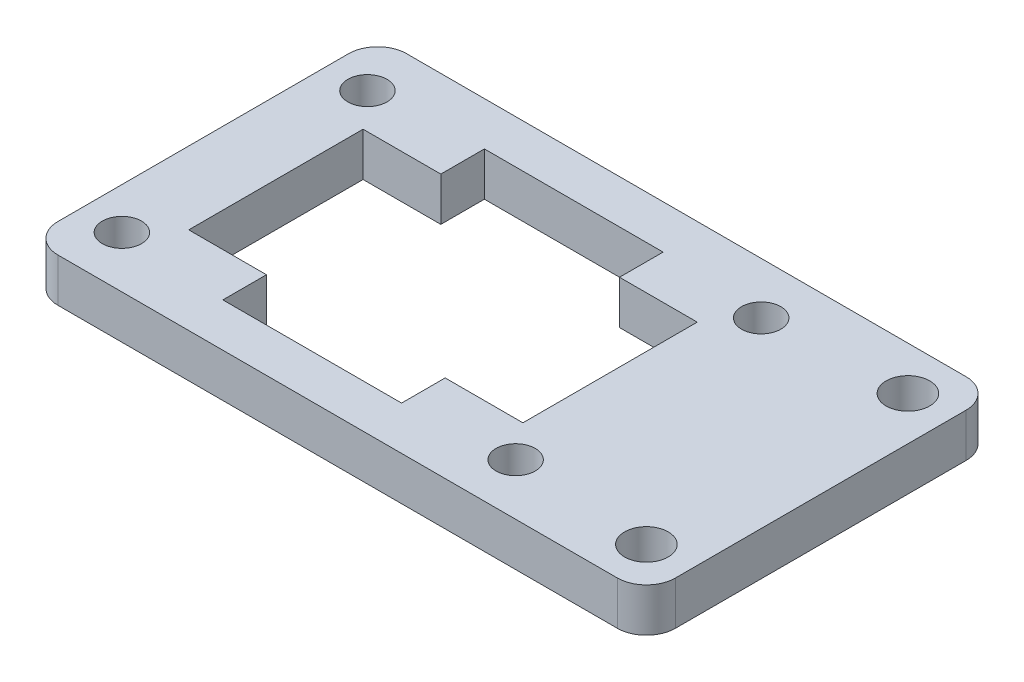
ISO-10303-21;
HEADER;
FILE_DESCRIPTION(('STEP AP214'),'2;1');
FILE_NAME('part.step','',(''),(''),'','','');
FILE_SCHEMA(('AUTOMOTIVE_DESIGN { 1 0 10303 214 1 1 1 1 }'));
ENDSEC;
DATA;
#1=APPLICATION_CONTEXT('core data for automotive mechanical design processes');
#2=APPLICATION_PROTOCOL_DEFINITION('international standard','automotive_design',2000,#1);
#3=PRODUCT_CONTEXT('',#1,'mechanical');
#4=PRODUCT('Part','Part','',(#3));
#5=PRODUCT_RELATED_PRODUCT_CATEGORY('part','',(#4));
#6=PRODUCT_DEFINITION_FORMATION('','',#4);
#7=PRODUCT_DEFINITION_CONTEXT('part definition',#1,'design');
#8=PRODUCT_DEFINITION('design','',#6,#7);
#9=PRODUCT_DEFINITION_SHAPE('','',#8);
#10=(LENGTH_UNIT() NAMED_UNIT(*) SI_UNIT(.MILLI.,.METRE.));
#11=(NAMED_UNIT(*) PLANE_ANGLE_UNIT() SI_UNIT($,.RADIAN.));
#12=(NAMED_UNIT(*) SI_UNIT($,.STERADIAN.) SOLID_ANGLE_UNIT());
#13=UNCERTAINTY_MEASURE_WITH_UNIT(LENGTH_MEASURE(1.E-05),#10,'distance_accuracy_value','');
#14=(GEOMETRIC_REPRESENTATION_CONTEXT(3) GLOBAL_UNCERTAINTY_ASSIGNED_CONTEXT((#13)) GLOBAL_UNIT_ASSIGNED_CONTEXT((#10,
#11,#12)) REPRESENTATION_CONTEXT('',''));
#15=CARTESIAN_POINT('',(0.,0.,0.));
#16=DIRECTION('',(0.,0.,1.));
#17=DIRECTION('',(1.,0.,0.));
#18=AXIS2_PLACEMENT_3D('',#15,#16,#17);
#19=CARTESIAN_POINT('',(0.,3.,-6.));
#20=DIRECTION('',(0.,0.,-1.));
#21=DIRECTION('',(-1.,0.,0.));
#22=AXIS2_PLACEMENT_3D('',#19,#20,#21);
#23=PLANE('',#22);
#24=DIRECTION('',(0.,1.,0.));
#25=VECTOR('',#24,1.);
#26=CARTESIAN_POINT('',(22.65,0.,-6.));
#27=LINE('',#26,#25);
#28=CARTESIAN_POINT('',(22.65,0.,-6.));
#29=VERTEX_POINT('',#28);
#30=CARTESIAN_POINT('',(22.65,3.,-6.));
#31=VERTEX_POINT('',#30);
#32=EDGE_CURVE('E329',#29,#31,#27,.T.);
#33=ORIENTED_EDGE('',*,*,#32,.T.);
#34=DIRECTION('',(1.,0.,0.));
#35=VECTOR('',#34,1.);
#36=CARTESIAN_POINT('',(0.,3.,-6.));
#37=LINE('',#36,#35);
#38=CARTESIAN_POINT('',(28.,3.,-6.));
#39=VERTEX_POINT('',#38);
#40=EDGE_CURVE('E358',#31,#39,#37,.T.);
#41=ORIENTED_EDGE('',*,*,#40,.T.);
#42=DIRECTION('',(0.,-1.,0.));
#43=VECTOR('',#42,1.);
#44=CARTESIAN_POINT('',(28.,3.,-6.));
#45=LINE('',#44,#43);
#46=CARTESIAN_POINT('',(28.,0.,-6.));
#47=VERTEX_POINT('',#46);
#48=EDGE_CURVE('E222',#39,#47,#45,.T.);
#49=ORIENTED_EDGE('',*,*,#48,.T.);
#50=DIRECTION('',(1.,0.,0.));
#51=VECTOR('',#50,1.);
#52=CARTESIAN_POINT('',(0.,0.,-6.));
#53=LINE('',#52,#51);
#54=EDGE_CURVE('E289',#29,#47,#53,.T.);
#55=ORIENTED_EDGE('',*,*,#54,.F.);
#56=EDGE_LOOP('',(#33,#41,#49,#55));
#57=FACE_BOUND('',#56,.T.);
#58=ADVANCED_FACE('F35',(#57),#23,.T.);
#59=CARTESIAN_POINT('',(0.,3.,-3.));
#60=DIRECTION('',(0.,0.,-1.));
#61=DIRECTION('',(-1.,0.,0.));
#62=AXIS2_PLACEMENT_3D('',#59,#60,#61);
#63=PLANE('',#62);
#64=DIRECTION('',(1.,0.,0.));
#65=VECTOR('',#64,1.);
#66=CARTESIAN_POINT('',(0.,0.,-3.));
#67=LINE('',#66,#65);
#68=CARTESIAN_POINT('',(10.35,0.,-3.));
#69=VERTEX_POINT('',#68);
#70=CARTESIAN_POINT('',(22.65,0.,-3.));
#71=VERTEX_POINT('',#70);
#72=EDGE_CURVE('E291',#69,#71,#67,.T.);
#73=ORIENTED_EDGE('',*,*,#72,.F.);
#74=DIRECTION('',(0.,1.,0.));
#75=VECTOR('',#74,1.);
#76=CARTESIAN_POINT('',(10.35,0.,-3.));
#77=LINE('',#76,#75);
#78=CARTESIAN_POINT('',(10.35,3.,-3.));
#79=VERTEX_POINT('',#78);
#80=EDGE_CURVE('E307',#69,#79,#77,.T.);
#81=ORIENTED_EDGE('',*,*,#80,.T.);
#82=DIRECTION('',(1.,0.,0.));
#83=VECTOR('',#82,1.);
#84=CARTESIAN_POINT('',(0.,3.,-3.));
#85=LINE('',#84,#83);
#86=CARTESIAN_POINT('',(22.65,3.,-3.));
#87=VERTEX_POINT('',#86);
#88=EDGE_CURVE('E360',#79,#87,#85,.T.);
#89=ORIENTED_EDGE('',*,*,#88,.T.);
#90=DIRECTION('',(0.,1.,0.));
#91=VECTOR('',#90,1.);
#92=CARTESIAN_POINT('',(22.65,0.,-3.));
#93=LINE('',#92,#91);
#94=EDGE_CURVE('E327',#71,#87,#93,.T.);
#95=ORIENTED_EDGE('',*,*,#94,.F.);
#96=EDGE_LOOP('',(#73,#81,#89,#95));
#97=FACE_BOUND('',#96,.T.);
#98=ADVANCED_FACE('F404',(#97),#63,.T.);
#99=DIRECTION('',(0.,1.,0.));
#100=VECTOR('',#99,1.);
#101=CARTESIAN_POINT('',(10.35,0.,-6.));
#102=LINE('',#101,#100);
#103=CARTESIAN_POINT('',(10.35,0.,-6.));
#104=VERTEX_POINT('',#103);
#105=CARTESIAN_POINT('',(10.35,3.,-6.));
#106=VERTEX_POINT('',#105);
#107=EDGE_CURVE('E302',#104,#106,#102,.T.);
#108=ORIENTED_EDGE('',*,*,#107,.F.);
#109=CARTESIAN_POINT('',(5.,0.,-6.));
#110=VERTEX_POINT('',#109);
#111=EDGE_CURVE('E204',#110,#104,#53,.T.);
#112=ORIENTED_EDGE('',*,*,#111,.F.);
#113=DIRECTION('',(0.,-1.,0.));
#114=VECTOR('',#113,1.);
#115=CARTESIAN_POINT('',(5.,3.,-6.));
#116=LINE('',#115,#114);
#117=CARTESIAN_POINT('',(5.,3.,-6.));
#118=VERTEX_POINT('',#117);
#119=EDGE_CURVE('E229',#118,#110,#116,.T.);
#120=ORIENTED_EDGE('',*,*,#119,.F.);
#121=EDGE_CURVE('E303',#118,#106,#37,.T.);
#122=ORIENTED_EDGE('',*,*,#121,.T.);
#123=EDGE_LOOP('',(#108,#112,#120,#122));
#124=FACE_BOUND('',#123,.T.);
#125=ADVANCED_FACE('F299',(#124),#23,.T.);
#126=CARTESIAN_POINT('',(5.,3.,0.));
#127=DIRECTION('',(1.,0.,0.));
#128=DIRECTION('',(0.,0.,-1.));
#129=AXIS2_PLACEMENT_3D('',#126,#127,#128);
#130=PLANE('',#129);
#131=DIRECTION('',(0.,0.,1.));
#132=VECTOR('',#131,1.);
#133=CARTESIAN_POINT('',(5.,0.,0.));
#134=LINE('',#133,#132);
#135=CARTESIAN_POINT('',(5.,0.,-18.));
#136=VERTEX_POINT('',#135);
#137=EDGE_CURVE('E200',#136,#110,#134,.T.);
#138=ORIENTED_EDGE('',*,*,#137,.F.);
#139=DIRECTION('',(0.,-1.,0.));
#140=VECTOR('',#139,1.);
#141=CARTESIAN_POINT('',(5.,3.,-18.));
#142=LINE('',#141,#140);
#143=CARTESIAN_POINT('',(5.,3.,-18.));
#144=VERTEX_POINT('',#143);
#145=EDGE_CURVE('E199',#144,#136,#142,.T.);
#146=ORIENTED_EDGE('',*,*,#145,.F.);
#147=DIRECTION('',(0.,0.,1.));
#148=VECTOR('',#147,1.);
#149=CARTESIAN_POINT('',(5.,3.,0.));
#150=LINE('',#149,#148);
#151=EDGE_CURVE('E362',#144,#118,#150,.T.);
#152=ORIENTED_EDGE('',*,*,#151,.T.);
#153=ORIENTED_EDGE('',*,*,#119,.T.);
#154=EDGE_LOOP('',(#138,#146,#152,#153));
#155=FACE_BOUND('',#154,.T.);
#156=ADVANCED_FACE('F414',(#155),#130,.T.);
#157=CARTESIAN_POINT('',(0.,3.,-18.));
#158=DIRECTION('',(0.,0.,-1.));
#159=DIRECTION('',(-1.,0.,0.));
#160=AXIS2_PLACEMENT_3D('',#157,#158,#159);
#161=PLANE('',#160);
#162=DIRECTION('',(1.,0.,0.));
#163=VECTOR('',#162,1.);
#164=CARTESIAN_POINT('',(0.,0.,-18.));
#165=LINE('',#164,#163);
#166=CARTESIAN_POINT('',(10.35,0.,-18.));
#167=VERTEX_POINT('',#166);
#168=EDGE_CURVE('E193',#136,#167,#165,.T.);
#169=ORIENTED_EDGE('',*,*,#168,.T.);
#170=DIRECTION('',(0.,1.,0.));
#171=VECTOR('',#170,1.);
#172=CARTESIAN_POINT('',(10.35,0.,-18.));
#173=LINE('',#172,#171);
#174=CARTESIAN_POINT('',(10.35,3.,-18.));
#175=VERTEX_POINT('',#174);
#176=EDGE_CURVE('E173',#167,#175,#173,.T.);
#177=ORIENTED_EDGE('',*,*,#176,.T.);
#178=DIRECTION('',(1.,0.,0.));
#179=VECTOR('',#178,1.);
#180=CARTESIAN_POINT('',(0.,3.,-18.));
#181=LINE('',#180,#179);
#182=EDGE_CURVE('E365',#144,#175,#181,.T.);
#183=ORIENTED_EDGE('',*,*,#182,.F.);
#184=ORIENTED_EDGE('',*,*,#145,.T.);
#185=EDGE_LOOP('',(#169,#177,#183,#184));
#186=FACE_BOUND('',#185,.T.);
#187=ADVANCED_FACE('F198',(#186),#161,.F.);
#188=CARTESIAN_POINT('',(0.,3.,-21.));
#189=DIRECTION('',(0.,0.,-1.));
#190=DIRECTION('',(-1.,0.,0.));
#191=AXIS2_PLACEMENT_3D('',#188,#189,#190);
#192=PLANE('',#191);
#193=DIRECTION('',(1.,0.,0.));
#194=VECTOR('',#193,1.);
#195=CARTESIAN_POINT('',(0.,0.,-21.));
#196=LINE('',#195,#194);
#197=CARTESIAN_POINT('',(10.35,0.,-21.));
#198=VERTEX_POINT('',#197);
#199=CARTESIAN_POINT('',(22.65,0.,-21.));
#200=VERTEX_POINT('',#199);
#201=EDGE_CURVE('E196',#198,#200,#196,.T.);
#202=ORIENTED_EDGE('',*,*,#201,.T.);
#203=DIRECTION('',(0.,1.,0.));
#204=VECTOR('',#203,1.);
#205=CARTESIAN_POINT('',(22.65,0.,-21.));
#206=LINE('',#205,#204);
#207=CARTESIAN_POINT('',(22.65,3.,-21.));
#208=VERTEX_POINT('',#207);
#209=EDGE_CURVE('E321',#200,#208,#206,.T.);
#210=ORIENTED_EDGE('',*,*,#209,.T.);
#211=DIRECTION('',(1.,0.,0.));
#212=VECTOR('',#211,1.);
#213=CARTESIAN_POINT('',(0.,3.,-21.));
#214=LINE('',#213,#212);
#215=CARTESIAN_POINT('',(10.35,3.,-21.));
#216=VERTEX_POINT('',#215);
#217=EDGE_CURVE('E367',#216,#208,#214,.T.);
#218=ORIENTED_EDGE('',*,*,#217,.F.);
#219=DIRECTION('',(0.,1.,0.));
#220=VECTOR('',#219,1.);
#221=CARTESIAN_POINT('',(10.35,0.,-21.));
#222=LINE('',#221,#220);
#223=EDGE_CURVE('E186',#198,#216,#222,.T.);
#224=ORIENTED_EDGE('',*,*,#223,.F.);
#225=EDGE_LOOP('',(#202,#210,#218,#224));
#226=FACE_BOUND('',#225,.T.);
#227=ADVANCED_FACE('F422',(#226),#192,.F.);
#228=CARTESIAN_POINT('',(22.65,3.,-18.));
#229=VERTEX_POINT('',#228);
#230=CARTESIAN_POINT('',(28.,3.,-18.));
#231=VERTEX_POINT('',#230);
#232=EDGE_CURVE('E368',#229,#231,#181,.T.);
#233=ORIENTED_EDGE('',*,*,#232,.F.);
#234=DIRECTION('',(0.,1.,0.));
#235=VECTOR('',#234,1.);
#236=CARTESIAN_POINT('',(22.65,0.,-18.));
#237=LINE('',#236,#235);
#238=CARTESIAN_POINT('',(22.65,0.,-18.));
#239=VERTEX_POINT('',#238);
#240=EDGE_CURVE('E318',#239,#229,#237,.T.);
#241=ORIENTED_EDGE('',*,*,#240,.F.);
#242=CARTESIAN_POINT('',(28.,0.,-18.));
#243=VERTEX_POINT('',#242);
#244=EDGE_CURVE('E202',#239,#243,#165,.T.);
#245=ORIENTED_EDGE('',*,*,#244,.T.);
#246=DIRECTION('',(0.,-1.,0.));
#247=VECTOR('',#246,1.);
#248=CARTESIAN_POINT('',(28.,3.,-18.));
#249=LINE('',#248,#247);
#250=EDGE_CURVE('E225',#231,#243,#249,.T.);
#251=ORIENTED_EDGE('',*,*,#250,.F.);
#252=EDGE_LOOP('',(#233,#241,#245,#251));
#253=FACE_BOUND('',#252,.T.);
#254=ADVANCED_FACE('F424',(#253),#161,.F.);
#255=CARTESIAN_POINT('',(0.,3.,0.));
#256=DIRECTION('',(0.,0.,-1.));
#257=DIRECTION('',(-1.,0.,0.));
#258=AXIS2_PLACEMENT_3D('',#255,#256,#257);
#259=PLANE('',#258);
#260=DIRECTION('',(1.,0.,0.));
#261=VECTOR('',#260,1.);
#262=CARTESIAN_POINT('',(0.,0.,0.));
#263=LINE('',#262,#261);
#264=CARTESIAN_POINT('',(2.,0.,0.));
#265=VERTEX_POINT('',#264);
#266=CARTESIAN_POINT('',(40.5,0.,0.));
#267=VERTEX_POINT('',#266);
#268=EDGE_CURVE('E266',#265,#267,#263,.T.);
#269=ORIENTED_EDGE('',*,*,#268,.T.);
#270=DIRECTION('',(0.,-1.,0.));
#271=VECTOR('',#270,1.);
#272=CARTESIAN_POINT('',(40.5,3.,0.));
#273=LINE('',#272,#271);
#274=CARTESIAN_POINT('',(40.5,3.,0.));
#275=VERTEX_POINT('',#274);
#276=EDGE_CURVE('E11',#267,#275,#273,.F.);
#277=ORIENTED_EDGE('',*,*,#276,.T.);
#278=DIRECTION('',(1.,0.,0.));
#279=VECTOR('',#278,1.);
#280=CARTESIAN_POINT('',(0.,3.,0.));
#281=LINE('',#280,#279);
#282=CARTESIAN_POINT('',(2.,3.,0.));
#283=VERTEX_POINT('',#282);
#284=EDGE_CURVE('E268',#283,#275,#281,.T.);
#285=ORIENTED_EDGE('',*,*,#284,.F.);
#286=DIRECTION('',(0.,-1.,0.));
#287=VECTOR('',#286,1.);
#288=CARTESIAN_POINT('',(2.,0.,0.));
#289=LINE('',#288,#287);
#290=EDGE_CURVE('E43',#283,#265,#289,.T.);
#291=ORIENTED_EDGE('',*,*,#290,.T.);
#292=EDGE_LOOP('',(#269,#277,#285,#291));
#293=FACE_BOUND('',#292,.T.);
#294=ADVANCED_FACE('F265',(#293),#259,.F.);
#295=CARTESIAN_POINT('',(42.5,3.,0.));
#296=DIRECTION('',(-1.,0.,0.));
#297=DIRECTION('',(0.,0.,1.));
#298=AXIS2_PLACEMENT_3D('',#295,#296,#297);
#299=PLANE('',#298);
#300=DIRECTION('',(0.,0.,-1.));
#301=VECTOR('',#300,1.);
#302=CARTESIAN_POINT('',(42.5,0.,0.));
#303=LINE('',#302,#301);
#304=CARTESIAN_POINT('',(42.5,0.,-2.));
#305=VERTEX_POINT('',#304);
#306=CARTESIAN_POINT('',(42.5,0.,-22.));
#307=VERTEX_POINT('',#306);
#308=EDGE_CURVE('E275',#305,#307,#303,.T.);
#309=ORIENTED_EDGE('',*,*,#308,.T.);
#310=DIRECTION('',(0.,-1.,0.));
#311=VECTOR('',#310,1.);
#312=CARTESIAN_POINT('',(42.5,3.,-22.));
#313=LINE('',#312,#311);
#314=CARTESIAN_POINT('',(42.5,3.,-22.));
#315=VERTEX_POINT('',#314);
#316=EDGE_CURVE('E50',#307,#315,#313,.F.);
#317=ORIENTED_EDGE('',*,*,#316,.T.);
#318=DIRECTION('',(0.,0.,-1.));
#319=VECTOR('',#318,1.);
#320=CARTESIAN_POINT('',(42.5,3.,0.));
#321=LINE('',#320,#319);
#322=CARTESIAN_POINT('',(42.5,3.,-2.));
#323=VERTEX_POINT('',#322);
#324=EDGE_CURVE('E350',#323,#315,#321,.T.);
#325=ORIENTED_EDGE('',*,*,#324,.F.);
#326=DIRECTION('',(0.,-1.,0.));
#327=VECTOR('',#326,1.);
#328=CARTESIAN_POINT('',(42.5,3.,-2.));
#329=LINE('',#328,#327);
#330=EDGE_CURVE('E256',#323,#305,#329,.T.);
#331=ORIENTED_EDGE('',*,*,#330,.T.);
#332=EDGE_LOOP('',(#309,#317,#325,#331));
#333=FACE_BOUND('',#332,.T.);
#334=ADVANCED_FACE('F539',(#333),#299,.F.);
#335=CARTESIAN_POINT('',(0.,3.,-24.));
#336=DIRECTION('',(0.,0.,-1.));
#337=DIRECTION('',(-1.,0.,0.));
#338=AXIS2_PLACEMENT_3D('',#335,#336,#337);
#339=PLANE('',#338);
#340=DIRECTION('',(1.,0.,0.));
#341=VECTOR('',#340,1.);
#342=CARTESIAN_POINT('',(0.,0.,-24.));
#343=LINE('',#342,#341);
#344=CARTESIAN_POINT('',(2.,0.,-24.));
#345=VERTEX_POINT('',#344);
#346=CARTESIAN_POINT('',(40.5,0.,-24.));
#347=VERTEX_POINT('',#346);
#348=EDGE_CURVE('E278',#345,#347,#343,.T.);
#349=ORIENTED_EDGE('',*,*,#348,.F.);
#350=DIRECTION('',(0.,-1.,0.));
#351=VECTOR('',#350,1.);
#352=CARTESIAN_POINT('',(2.,3.,-24.));
#353=LINE('',#352,#351);
#354=CARTESIAN_POINT('',(2.,3.,-24.));
#355=VERTEX_POINT('',#354);
#356=EDGE_CURVE('E247',#345,#355,#353,.F.);
#357=ORIENTED_EDGE('',*,*,#356,.T.);
#358=DIRECTION('',(1.,0.,0.));
#359=VECTOR('',#358,1.);
#360=CARTESIAN_POINT('',(0.,3.,-24.));
#361=LINE('',#360,#359);
#362=CARTESIAN_POINT('',(40.5,3.,-24.));
#363=VERTEX_POINT('',#362);
#364=EDGE_CURVE('E352',#355,#363,#361,.T.);
#365=ORIENTED_EDGE('',*,*,#364,.T.);
#366=DIRECTION('',(0.,-1.,0.));
#367=VECTOR('',#366,1.);
#368=CARTESIAN_POINT('',(40.5,0.,-24.));
#369=LINE('',#368,#367);
#370=EDGE_CURVE('E244',#363,#347,#369,.T.);
#371=ORIENTED_EDGE('',*,*,#370,.T.);
#372=EDGE_LOOP('',(#349,#357,#365,#371));
#373=FACE_BOUND('',#372,.T.);
#374=ADVANCED_FACE('F548',(#373),#339,.T.);
#375=CARTESIAN_POINT('',(0.,3.,0.));
#376=DIRECTION('',(-1.,0.,0.));
#377=DIRECTION('',(0.,0.,1.));
#378=AXIS2_PLACEMENT_3D('',#375,#376,#377);
#379=PLANE('',#378);
#380=DIRECTION('',(0.,0.,-1.));
#381=VECTOR('',#380,1.);
#382=CARTESIAN_POINT('',(0.,3.,0.));
#383=LINE('',#382,#381);
#384=CARTESIAN_POINT('',(0.,3.,-2.));
#385=VERTEX_POINT('',#384);
#386=CARTESIAN_POINT('',(0.,3.,-22.));
#387=VERTEX_POINT('',#386);
#388=EDGE_CURVE('E355',#385,#387,#383,.T.);
#389=ORIENTED_EDGE('',*,*,#388,.T.);
#390=DIRECTION('',(0.,-1.,0.));
#391=VECTOR('',#390,1.);
#392=CARTESIAN_POINT('',(0.,3.,-22.));
#393=LINE('',#392,#391);
#394=CARTESIAN_POINT('',(0.,0.,-22.));
#395=VERTEX_POINT('',#394);
#396=EDGE_CURVE('E233',#387,#395,#393,.T.);
#397=ORIENTED_EDGE('',*,*,#396,.T.);
#398=DIRECTION('',(0.,0.,-1.));
#399=VECTOR('',#398,1.);
#400=CARTESIAN_POINT('',(0.,0.,0.));
#401=LINE('',#400,#399);
#402=CARTESIAN_POINT('',(0.,0.,-2.));
#403=VERTEX_POINT('',#402);
#404=EDGE_CURVE('E287',#403,#395,#401,.T.);
#405=ORIENTED_EDGE('',*,*,#404,.F.);
#406=DIRECTION('',(0.,-1.,0.));
#407=VECTOR('',#406,1.);
#408=CARTESIAN_POINT('',(0.,3.,-2.));
#409=LINE('',#408,#407);
#410=EDGE_CURVE('E231',#403,#385,#409,.F.);
#411=ORIENTED_EDGE('',*,*,#410,.T.);
#412=EDGE_LOOP('',(#389,#397,#405,#411));
#413=FACE_BOUND('',#412,.T.);
#414=ADVANCED_FACE('F400',(#413),#379,.T.);
#415=CARTESIAN_POINT('',(2.85,3.,-20.45));
#416=DIRECTION('',(0.,-1.,0.));
#417=DIRECTION('',(0.,0.,-1.));
#418=AXIS2_PLACEMENT_3D('',#415,#416,#417);
#419=CYLINDRICAL_SURFACE('',#418,1.35);
#420=CARTESIAN_POINT('',(2.85,3.,-20.45));
#421=DIRECTION('',(0.,1.,0.));
#422=DIRECTION('',(0.,0.,1.));
#423=AXIS2_PLACEMENT_3D('',#420,#421,#422);
#424=CIRCLE('',#423,1.35);
#425=CARTESIAN_POINT('',(2.85,3.,-19.1));
#426=VERTEX_POINT('',#425);
#427=EDGE_CURVE('E346',#426,#426,#424,.T.);
#428=ORIENTED_EDGE('',*,*,#427,.T.);
#429=EDGE_LOOP('',(#428));
#430=FACE_BOUND('',#429,.T.);
#431=CARTESIAN_POINT('',(2.85,0.,-20.45));
#432=DIRECTION('',(0.,1.,0.));
#433=DIRECTION('',(0.,0.,1.));
#434=AXIS2_PLACEMENT_3D('',#431,#432,#433);
#435=CIRCLE('',#434,1.35);
#436=CARTESIAN_POINT('',(2.85,0.,-19.1));
#437=VERTEX_POINT('',#436);
#438=EDGE_CURVE('E276',#437,#437,#435,.T.);
#439=ORIENTED_EDGE('',*,*,#438,.F.);
#440=EDGE_LOOP('',(#439));
#441=FACE_BOUND('',#440,.T.);
#442=ADVANCED_FACE('F390',(#430,#441),#419,.F.);
#443=CARTESIAN_POINT('',(2.85,3.,-3.55));
#444=DIRECTION('',(0.,-1.,0.));
#445=DIRECTION('',(0.,0.,-1.));
#446=AXIS2_PLACEMENT_3D('',#443,#444,#445);
#447=CYLINDRICAL_SURFACE('',#446,1.35);
#448=CARTESIAN_POINT('',(2.85,3.,-3.55));
#449=DIRECTION('',(0.,1.,0.));
#450=DIRECTION('',(0.,0.,1.));
#451=AXIS2_PLACEMENT_3D('',#448,#449,#450);
#452=CIRCLE('',#451,1.35);
#453=CARTESIAN_POINT('',(2.85,3.,-2.2));
#454=VERTEX_POINT('',#453);
#455=EDGE_CURVE('E343',#454,#454,#452,.T.);
#456=ORIENTED_EDGE('',*,*,#455,.T.);
#457=EDGE_LOOP('',(#456));
#458=FACE_BOUND('',#457,.T.);
#459=CARTESIAN_POINT('',(2.85,0.,-3.55));
#460=DIRECTION('',(0.,1.,0.));
#461=DIRECTION('',(0.,0.,1.));
#462=AXIS2_PLACEMENT_3D('',#459,#460,#461);
#463=CIRCLE('',#462,1.35);
#464=CARTESIAN_POINT('',(2.85,0.,-2.2));
#465=VERTEX_POINT('',#464);
#466=EDGE_CURVE('E281',#465,#465,#463,.T.);
#467=ORIENTED_EDGE('',*,*,#466,.F.);
#468=EDGE_LOOP('',(#467));
#469=FACE_BOUND('',#468,.T.);
#470=ADVANCED_FACE('F387',(#458,#469),#447,.F.);
#471=CARTESIAN_POINT('',(29.95,3.,-20.45));
#472=DIRECTION('',(0.,-1.,0.));
#473=DIRECTION('',(0.,0.,-1.));
#474=AXIS2_PLACEMENT_3D('',#471,#472,#473);
#475=CYLINDRICAL_SURFACE('',#474,1.35);
#476=CARTESIAN_POINT('',(29.95,3.,-20.45));
#477=DIRECTION('',(0.,1.,0.));
#478=DIRECTION('',(0.,0.,1.));
#479=AXIS2_PLACEMENT_3D('',#476,#477,#478);
#480=CIRCLE('',#479,1.35);
#481=CARTESIAN_POINT('',(29.95,3.,-19.1));
#482=VERTEX_POINT('',#481);
#483=EDGE_CURVE('E340',#482,#482,#480,.T.);
#484=ORIENTED_EDGE('',*,*,#483,.T.);
#485=EDGE_LOOP('',(#484));
#486=FACE_BOUND('',#485,.T.);
#487=CARTESIAN_POINT('',(29.95,0.,-20.45));
#488=DIRECTION('',(0.,1.,0.));
#489=DIRECTION('',(0.,0.,1.));
#490=AXIS2_PLACEMENT_3D('',#487,#488,#489);
#491=CIRCLE('',#490,1.35);
#492=CARTESIAN_POINT('',(29.95,0.,-19.1));
#493=VERTEX_POINT('',#492);
#494=EDGE_CURVE('E380',#493,#493,#491,.T.);
#495=ORIENTED_EDGE('',*,*,#494,.F.);
#496=EDGE_LOOP('',(#495));
#497=FACE_BOUND('',#496,.T.);
#498=ADVANCED_FACE('F389',(#486,#497),#475,.F.);
#499=CARTESIAN_POINT('',(29.95,3.,-3.55));
#500=DIRECTION('',(0.,-1.,0.));
#501=DIRECTION('',(0.,0.,-1.));
#502=AXIS2_PLACEMENT_3D('',#499,#500,#501);
#503=CYLINDRICAL_SURFACE('',#502,1.35);
#504=CARTESIAN_POINT('',(29.95,3.,-3.55));
#505=DIRECTION('',(0.,1.,0.));
#506=DIRECTION('',(0.,0.,1.));
#507=AXIS2_PLACEMENT_3D('',#504,#505,#506);
#508=CIRCLE('',#507,1.35);
#509=CARTESIAN_POINT('',(29.95,3.,-2.2));
#510=VERTEX_POINT('',#509);
#511=EDGE_CURVE('E337',#510,#510,#508,.T.);
#512=ORIENTED_EDGE('',*,*,#511,.T.);
#513=EDGE_LOOP('',(#512));
#514=FACE_BOUND('',#513,.T.);
#515=CARTESIAN_POINT('',(29.95,0.,-3.55));
#516=DIRECTION('',(0.,1.,0.));
#517=DIRECTION('',(0.,0.,1.));
#518=AXIS2_PLACEMENT_3D('',#515,#516,#517);
#519=CIRCLE('',#518,1.35);
#520=CARTESIAN_POINT('',(29.95,0.,-2.2));
#521=VERTEX_POINT('',#520);
#522=EDGE_CURVE('E377',#521,#521,#519,.T.);
#523=ORIENTED_EDGE('',*,*,#522,.F.);
#524=EDGE_LOOP('',(#523));
#525=FACE_BOUND('',#524,.T.);
#526=ADVANCED_FACE('F397',(#514,#525),#503,.F.);
#527=CARTESIAN_POINT('',(39.5,3.,-3.));
#528=DIRECTION('',(0.,-1.,0.));
#529=DIRECTION('',(0.,0.,-1.));
#530=AXIS2_PLACEMENT_3D('',#527,#528,#529);
#531=CYLINDRICAL_SURFACE('',#530,1.5);
#532=CARTESIAN_POINT('',(39.5,3.,-3.));
#533=DIRECTION('',(0.,1.,0.));
#534=DIRECTION('',(0.,0.,1.));
#535=AXIS2_PLACEMENT_3D('',#532,#533,#534);
#536=CIRCLE('',#535,1.5);
#537=CARTESIAN_POINT('',(39.5,3.,-1.5));
#538=VERTEX_POINT('',#537);
#539=EDGE_CURVE('E219',#538,#538,#536,.T.);
#540=ORIENTED_EDGE('',*,*,#539,.T.);
#541=EDGE_LOOP('',(#540));
#542=FACE_BOUND('',#541,.T.);
#543=CARTESIAN_POINT('',(39.5,0.,-3.));
#544=DIRECTION('',(0.,1.,0.));
#545=DIRECTION('',(0.,0.,1.));
#546=AXIS2_PLACEMENT_3D('',#543,#544,#545);
#547=CIRCLE('',#546,1.5);
#548=CARTESIAN_POINT('',(39.5,0.,-1.5));
#549=VERTEX_POINT('',#548);
#550=EDGE_CURVE('E374',#549,#549,#547,.T.);
#551=ORIENTED_EDGE('',*,*,#550,.F.);
#552=EDGE_LOOP('',(#551));
#553=FACE_BOUND('',#552,.T.);
#554=ADVANCED_FACE('F593',(#542,#553),#531,.F.);
#555=CARTESIAN_POINT('',(39.5,3.,-21.));
#556=DIRECTION('',(0.,-1.,0.));
#557=DIRECTION('',(0.,0.,-1.));
#558=AXIS2_PLACEMENT_3D('',#555,#556,#557);
#559=CYLINDRICAL_SURFACE('',#558,1.5);
#560=CARTESIAN_POINT('',(39.5,3.,-21.));
#561=DIRECTION('',(0.,1.,0.));
#562=DIRECTION('',(0.,0.,1.));
#563=AXIS2_PLACEMENT_3D('',#560,#561,#562);
#564=CIRCLE('',#563,1.5);
#565=CARTESIAN_POINT('',(39.5,3.,-19.5));
#566=VERTEX_POINT('',#565);
#567=EDGE_CURVE('E213',#566,#566,#564,.T.);
#568=ORIENTED_EDGE('',*,*,#567,.T.);
#569=EDGE_LOOP('',(#568));
#570=FACE_BOUND('',#569,.T.);
#571=CARTESIAN_POINT('',(39.5,0.,-21.));
#572=DIRECTION('',(0.,1.,0.));
#573=DIRECTION('',(0.,0.,1.));
#574=AXIS2_PLACEMENT_3D('',#571,#572,#573);
#575=CIRCLE('',#574,1.5);
#576=CARTESIAN_POINT('',(39.5,0.,-19.5));
#577=VERTEX_POINT('',#576);
#578=EDGE_CURVE('E332',#577,#577,#575,.T.);
#579=ORIENTED_EDGE('',*,*,#578,.F.);
#580=EDGE_LOOP('',(#579));
#581=FACE_BOUND('',#580,.T.);
#582=ADVANCED_FACE('F434',(#570,#581),#559,.F.);
#583=CARTESIAN_POINT('',(28.,3.,0.));
#584=DIRECTION('',(1.,0.,0.));
#585=DIRECTION('',(0.,0.,-1.));
#586=AXIS2_PLACEMENT_3D('',#583,#584,#585);
#587=PLANE('',#586);
#588=DIRECTION('',(0.,0.,1.));
#589=VECTOR('',#588,1.);
#590=CARTESIAN_POINT('',(28.,0.,0.));
#591=LINE('',#590,#589);
#592=EDGE_CURVE('E206',#243,#47,#591,.T.);
#593=ORIENTED_EDGE('',*,*,#592,.T.);
#594=ORIENTED_EDGE('',*,*,#48,.F.);
#595=DIRECTION('',(0.,0.,1.));
#596=VECTOR('',#595,1.);
#597=CARTESIAN_POINT('',(28.,3.,0.));
#598=LINE('',#597,#596);
#599=EDGE_CURVE('E226',#231,#39,#598,.T.);
#600=ORIENTED_EDGE('',*,*,#599,.F.);
#601=ORIENTED_EDGE('',*,*,#250,.T.);
#602=EDGE_LOOP('',(#593,#594,#600,#601));
#603=FACE_BOUND('',#602,.T.);
#604=ADVANCED_FACE('F430',(#603),#587,.F.);
#605=CARTESIAN_POINT('',(0.,3.,0.));
#606=DIRECTION('',(0.,1.,0.));
#607=DIRECTION('',(0.,0.,1.));
#608=AXIS2_PLACEMENT_3D('',#605,#606,#607);
#609=PLANE('',#608);
#610=ORIENTED_EDGE('',*,*,#88,.F.);
#611=DIRECTION('',(0.,0.,1.));
#612=VECTOR('',#611,1.);
#613=CARTESIAN_POINT('',(10.35,3.,-6.));
#614=LINE('',#613,#612);
#615=EDGE_CURVE('E312',#106,#79,#614,.T.);
#616=ORIENTED_EDGE('',*,*,#615,.F.);
#617=ORIENTED_EDGE('',*,*,#121,.F.);
#618=ORIENTED_EDGE('',*,*,#151,.F.);
#619=ORIENTED_EDGE('',*,*,#182,.T.);
#620=DIRECTION('',(0.,0.,1.));
#621=VECTOR('',#620,1.);
#622=CARTESIAN_POINT('',(10.35,3.,-18.));
#623=LINE('',#622,#621);
#624=EDGE_CURVE('E180',#216,#175,#623,.T.);
#625=ORIENTED_EDGE('',*,*,#624,.F.);
#626=ORIENTED_EDGE('',*,*,#217,.T.);
#627=DIRECTION('',(0.,0.,-1.));
#628=VECTOR('',#627,1.);
#629=CARTESIAN_POINT('',(22.65,3.,-18.));
#630=LINE('',#629,#628);
#631=EDGE_CURVE('E185',#229,#208,#630,.T.);
#632=ORIENTED_EDGE('',*,*,#631,.F.);
#633=ORIENTED_EDGE('',*,*,#232,.T.);
#634=ORIENTED_EDGE('',*,*,#599,.T.);
#635=ORIENTED_EDGE('',*,*,#40,.F.);
#636=DIRECTION('',(0.,0.,-1.));
#637=VECTOR('',#636,1.);
#638=CARTESIAN_POINT('',(22.65,3.,-6.));
#639=LINE('',#638,#637);
#640=EDGE_CURVE('E310',#87,#31,#639,.T.);
#641=ORIENTED_EDGE('',*,*,#640,.F.);
#642=EDGE_LOOP('',(#610,#616,#617,#618,#619,#625,#626,#632,#633,#634,#635,#641));
#643=FACE_BOUND('',#642,.T.);
#644=ORIENTED_EDGE('',*,*,#567,.F.);
#645=EDGE_LOOP('',(#644));
#646=FACE_BOUND('',#645,.T.);
#647=ORIENTED_EDGE('',*,*,#539,.F.);
#648=EDGE_LOOP('',(#647));
#649=FACE_BOUND('',#648,.T.);
#650=ORIENTED_EDGE('',*,*,#511,.F.);
#651=EDGE_LOOP('',(#650));
#652=FACE_BOUND('',#651,.T.);
#653=ORIENTED_EDGE('',*,*,#483,.F.);
#654=EDGE_LOOP('',(#653));
#655=FACE_BOUND('',#654,.T.);
#656=ORIENTED_EDGE('',*,*,#455,.F.);
#657=EDGE_LOOP('',(#656));
#658=FACE_BOUND('',#657,.T.);
#659=ORIENTED_EDGE('',*,*,#427,.F.);
#660=EDGE_LOOP('',(#659));
#661=FACE_BOUND('',#660,.T.);
#662=ORIENTED_EDGE('',*,*,#364,.F.);
#663=CARTESIAN_POINT('',(2.,3.,-22.));
#664=DIRECTION('',(0.,1.,0.));
#665=DIRECTION('',(0.,0.,1.));
#666=AXIS2_PLACEMENT_3D('',#663,#664,#665);
#667=CIRCLE('',#666,2.);
#668=EDGE_CURVE('E254',#355,#387,#667,.T.);
#669=ORIENTED_EDGE('',*,*,#668,.T.);
#670=ORIENTED_EDGE('',*,*,#388,.F.);
#671=CARTESIAN_POINT('',(2.,3.,-2.));
#672=DIRECTION('',(0.,1.,0.));
#673=DIRECTION('',(0.,0.,1.));
#674=AXIS2_PLACEMENT_3D('',#671,#672,#673);
#675=CIRCLE('',#674,2.);
#676=EDGE_CURVE('E249',#385,#283,#675,.T.);
#677=ORIENTED_EDGE('',*,*,#676,.T.);
#678=ORIENTED_EDGE('',*,*,#284,.T.);
#679=CARTESIAN_POINT('',(40.5,3.,-2.));
#680=DIRECTION('',(0.,1.,0.));
#681=DIRECTION('',(0.,0.,1.));
#682=AXIS2_PLACEMENT_3D('',#679,#680,#681);
#683=CIRCLE('',#682,2.);
#684=EDGE_CURVE('E57',#275,#323,#683,.T.);
#685=ORIENTED_EDGE('',*,*,#684,.T.);
#686=ORIENTED_EDGE('',*,*,#324,.T.);
#687=CARTESIAN_POINT('',(40.5,3.,-22.));
#688=DIRECTION('',(0.,1.,0.));
#689=DIRECTION('',(0.,0.,1.));
#690=AXIS2_PLACEMENT_3D('',#687,#688,#689);
#691=CIRCLE('',#690,2.);
#692=EDGE_CURVE('E252',#315,#363,#691,.T.);
#693=ORIENTED_EDGE('',*,*,#692,.T.);
#694=EDGE_LOOP('',(#662,#669,#670,#677,#678,#685,#686,#693));
#695=FACE_BOUND('',#694,.T.);
#696=ADVANCED_FACE('F433',(#643,#646,#649,#652,#655,#658,#661,#695),#609,.T.);
#697=CARTESIAN_POINT('',(0.,0.,0.));
#698=DIRECTION('',(0.,1.,0.));
#699=DIRECTION('',(0.,0.,1.));
#700=AXIS2_PLACEMENT_3D('',#697,#698,#699);
#701=PLANE('',#700);
#702=ORIENTED_EDGE('',*,*,#578,.T.);
#703=EDGE_LOOP('',(#702));
#704=FACE_BOUND('',#703,.T.);
#705=ORIENTED_EDGE('',*,*,#550,.T.);
#706=EDGE_LOOP('',(#705));
#707=FACE_BOUND('',#706,.T.);
#708=ORIENTED_EDGE('',*,*,#522,.T.);
#709=EDGE_LOOP('',(#708));
#710=FACE_BOUND('',#709,.T.);
#711=ORIENTED_EDGE('',*,*,#494,.T.);
#712=EDGE_LOOP('',(#711));
#713=FACE_BOUND('',#712,.T.);
#714=ORIENTED_EDGE('',*,*,#466,.T.);
#715=EDGE_LOOP('',(#714));
#716=FACE_BOUND('',#715,.T.);
#717=ORIENTED_EDGE('',*,*,#438,.T.);
#718=EDGE_LOOP('',(#717));
#719=FACE_BOUND('',#718,.T.);
#720=ORIENTED_EDGE('',*,*,#404,.T.);
#721=CARTESIAN_POINT('',(2.,0.,-22.));
#722=DIRECTION('',(0.,1.,0.));
#723=DIRECTION('',(0.,0.,1.));
#724=AXIS2_PLACEMENT_3D('',#721,#722,#723);
#725=CIRCLE('',#724,2.);
#726=EDGE_CURVE('E242',#395,#345,#725,.F.);
#727=ORIENTED_EDGE('',*,*,#726,.T.);
#728=ORIENTED_EDGE('',*,*,#348,.T.);
#729=CARTESIAN_POINT('',(40.5,0.,-22.));
#730=DIRECTION('',(0.,1.,0.));
#731=DIRECTION('',(0.,0.,1.));
#732=AXIS2_PLACEMENT_3D('',#729,#730,#731);
#733=CIRCLE('',#732,2.);
#734=EDGE_CURVE('E240',#347,#307,#733,.F.);
#735=ORIENTED_EDGE('',*,*,#734,.T.);
#736=ORIENTED_EDGE('',*,*,#308,.F.);
#737=CARTESIAN_POINT('',(40.5,0.,-2.));
#738=DIRECTION('',(0.,1.,0.));
#739=DIRECTION('',(0.,0.,1.));
#740=AXIS2_PLACEMENT_3D('',#737,#738,#739);
#741=CIRCLE('',#740,2.);
#742=EDGE_CURVE('E238',#305,#267,#741,.F.);
#743=ORIENTED_EDGE('',*,*,#742,.T.);
#744=ORIENTED_EDGE('',*,*,#268,.F.);
#745=CARTESIAN_POINT('',(2.,0.,-2.));
#746=DIRECTION('',(0.,1.,0.));
#747=DIRECTION('',(0.,0.,1.));
#748=AXIS2_PLACEMENT_3D('',#745,#746,#747);
#749=CIRCLE('',#748,2.);
#750=EDGE_CURVE('E236',#265,#403,#749,.F.);
#751=ORIENTED_EDGE('',*,*,#750,.T.);
#752=EDGE_LOOP('',(#720,#727,#728,#735,#736,#743,#744,#751));
#753=FACE_BOUND('',#752,.T.);
#754=DIRECTION('',(0.,0.,1.));
#755=VECTOR('',#754,1.);
#756=CARTESIAN_POINT('',(10.35,0.,-6.));
#757=LINE('',#756,#755);
#758=EDGE_CURVE('E296',#104,#69,#757,.T.);
#759=ORIENTED_EDGE('',*,*,#758,.T.);
#760=ORIENTED_EDGE('',*,*,#72,.T.);
#761=DIRECTION('',(0.,0.,-1.));
#762=VECTOR('',#761,1.);
#763=CARTESIAN_POINT('',(22.65,0.,-6.));
#764=LINE('',#763,#762);
#765=EDGE_CURVE('E325',#71,#29,#764,.T.);
#766=ORIENTED_EDGE('',*,*,#765,.T.);
#767=ORIENTED_EDGE('',*,*,#54,.T.);
#768=ORIENTED_EDGE('',*,*,#592,.F.);
#769=ORIENTED_EDGE('',*,*,#244,.F.);
#770=DIRECTION('',(0.,0.,-1.));
#771=VECTOR('',#770,1.);
#772=CARTESIAN_POINT('',(22.65,0.,-18.));
#773=LINE('',#772,#771);
#774=EDGE_CURVE('E316',#239,#200,#773,.T.);
#775=ORIENTED_EDGE('',*,*,#774,.T.);
#776=ORIENTED_EDGE('',*,*,#201,.F.);
#777=DIRECTION('',(0.,0.,1.));
#778=VECTOR('',#777,1.);
#779=CARTESIAN_POINT('',(10.35,0.,-18.));
#780=LINE('',#779,#778);
#781=EDGE_CURVE('E177',#198,#167,#780,.T.);
#782=ORIENTED_EDGE('',*,*,#781,.T.);
#783=ORIENTED_EDGE('',*,*,#168,.F.);
#784=ORIENTED_EDGE('',*,*,#137,.T.);
#785=ORIENTED_EDGE('',*,*,#111,.T.);
#786=EDGE_LOOP('',(#759,#760,#766,#767,#768,#769,#775,#776,#782,#783,#784,#785));
#787=FACE_BOUND('',#786,.T.);
#788=ADVANCED_FACE('F191',(#704,#707,#710,#713,#716,#719,#753,#787),#701,.F.);
#789=CARTESIAN_POINT('',(22.65,0.,-6.));
#790=DIRECTION('',(1.,0.,0.));
#791=DIRECTION('',(0.,0.,-1.));
#792=AXIS2_PLACEMENT_3D('',#789,#790,#791);
#793=PLANE('',#792);
#794=ORIENTED_EDGE('',*,*,#640,.T.);
#795=ORIENTED_EDGE('',*,*,#32,.F.);
#796=ORIENTED_EDGE('',*,*,#765,.F.);
#797=ORIENTED_EDGE('',*,*,#94,.T.);
#798=EDGE_LOOP('',(#794,#795,#796,#797));
#799=FACE_BOUND('',#798,.T.);
#800=ADVANCED_FACE('F437',(#799),#793,.F.);
#801=CARTESIAN_POINT('',(10.35,0.,-18.));
#802=DIRECTION('',(-1.,0.,0.));
#803=DIRECTION('',(0.,0.,1.));
#804=AXIS2_PLACEMENT_3D('',#801,#802,#803);
#805=PLANE('',#804);
#806=ORIENTED_EDGE('',*,*,#624,.T.);
#807=ORIENTED_EDGE('',*,*,#176,.F.);
#808=ORIENTED_EDGE('',*,*,#781,.F.);
#809=ORIENTED_EDGE('',*,*,#223,.T.);
#810=EDGE_LOOP('',(#806,#807,#808,#809));
#811=FACE_BOUND('',#810,.T.);
#812=ADVANCED_FACE('F175',(#811),#805,.F.);
#813=CARTESIAN_POINT('',(22.65,0.,-18.));
#814=DIRECTION('',(1.,0.,0.));
#815=DIRECTION('',(0.,0.,-1.));
#816=AXIS2_PLACEMENT_3D('',#813,#814,#815);
#817=PLANE('',#816);
#818=ORIENTED_EDGE('',*,*,#631,.T.);
#819=ORIENTED_EDGE('',*,*,#209,.F.);
#820=ORIENTED_EDGE('',*,*,#774,.F.);
#821=ORIENTED_EDGE('',*,*,#240,.T.);
#822=EDGE_LOOP('',(#818,#819,#820,#821));
#823=FACE_BOUND('',#822,.T.);
#824=ADVANCED_FACE('F445',(#823),#817,.F.);
#825=CARTESIAN_POINT('',(10.35,0.,-6.));
#826=DIRECTION('',(-1.,0.,0.));
#827=DIRECTION('',(0.,0.,1.));
#828=AXIS2_PLACEMENT_3D('',#825,#826,#827);
#829=PLANE('',#828);
#830=ORIENTED_EDGE('',*,*,#615,.T.);
#831=ORIENTED_EDGE('',*,*,#80,.F.);
#832=ORIENTED_EDGE('',*,*,#758,.F.);
#833=ORIENTED_EDGE('',*,*,#107,.T.);
#834=EDGE_LOOP('',(#830,#831,#832,#833));
#835=FACE_BOUND('',#834,.T.);
#836=ADVANCED_FACE('F448',(#835),#829,.F.);
#837=CARTESIAN_POINT('',(2.,3.,-22.));
#838=DIRECTION('',(0.,-1.,0.));
#839=DIRECTION('',(0.,0.,-1.));
#840=AXIS2_PLACEMENT_3D('',#837,#838,#839);
#841=CYLINDRICAL_SURFACE('',#840,2.);
#842=ORIENTED_EDGE('',*,*,#668,.F.);
#843=ORIENTED_EDGE('',*,*,#356,.F.);
#844=ORIENTED_EDGE('',*,*,#726,.F.);
#845=ORIENTED_EDGE('',*,*,#396,.F.);
#846=EDGE_LOOP('',(#842,#843,#844,#845));
#847=FACE_BOUND('',#846,.T.);
#848=ADVANCED_FACE('F452',(#847),#841,.T.);
#849=CARTESIAN_POINT('',(40.5,3.,-22.));
#850=DIRECTION('',(0.,1.,0.));
#851=DIRECTION('',(0.,0.,1.));
#852=AXIS2_PLACEMENT_3D('',#849,#850,#851);
#853=CYLINDRICAL_SURFACE('',#852,2.);
#854=ORIENTED_EDGE('',*,*,#692,.F.);
#855=ORIENTED_EDGE('',*,*,#316,.F.);
#856=ORIENTED_EDGE('',*,*,#734,.F.);
#857=ORIENTED_EDGE('',*,*,#370,.F.);
#858=EDGE_LOOP('',(#854,#855,#856,#857));
#859=FACE_BOUND('',#858,.T.);
#860=ADVANCED_FACE('F474',(#859),#853,.T.);
#861=CARTESIAN_POINT('',(40.5,3.,-2.));
#862=DIRECTION('',(0.,-1.,0.));
#863=DIRECTION('',(0.,0.,-1.));
#864=AXIS2_PLACEMENT_3D('',#861,#862,#863);
#865=CYLINDRICAL_SURFACE('',#864,2.);
#866=ORIENTED_EDGE('',*,*,#684,.F.);
#867=ORIENTED_EDGE('',*,*,#276,.F.);
#868=ORIENTED_EDGE('',*,*,#742,.F.);
#869=ORIENTED_EDGE('',*,*,#330,.F.);
#870=EDGE_LOOP('',(#866,#867,#868,#869));
#871=FACE_BOUND('',#870,.T.);
#872=ADVANCED_FACE('F482',(#871),#865,.T.);
#873=CARTESIAN_POINT('',(2.,3.,-2.));
#874=DIRECTION('',(0.,1.,0.));
#875=DIRECTION('',(0.,0.,1.));
#876=AXIS2_PLACEMENT_3D('',#873,#874,#875);
#877=CYLINDRICAL_SURFACE('',#876,2.);
#878=ORIENTED_EDGE('',*,*,#676,.F.);
#879=ORIENTED_EDGE('',*,*,#410,.F.);
#880=ORIENTED_EDGE('',*,*,#750,.F.);
#881=ORIENTED_EDGE('',*,*,#290,.F.);
#882=EDGE_LOOP('',(#878,#879,#880,#881));
#883=FACE_BOUND('',#882,.T.);
#884=ADVANCED_FACE('F37',(#883),#877,.T.);
#885=CLOSED_SHELL('',(#58,#98,#125,#156,#187,#227,#254,#294,#334,#374,#414,#442,#470,#498,#526,
#554,#582,#604,#696,#788,#800,#812,#824,#836,#848,#860,#872,#884));
#886=MANIFOLD_SOLID_BREP('B2',#885);
#887=ADVANCED_BREP_SHAPE_REPRESENTATION('',(#18,#886),#14);
#888=SHAPE_DEFINITION_REPRESENTATION(#9,#887);
ENDSEC;
END-ISO-10303-21;
